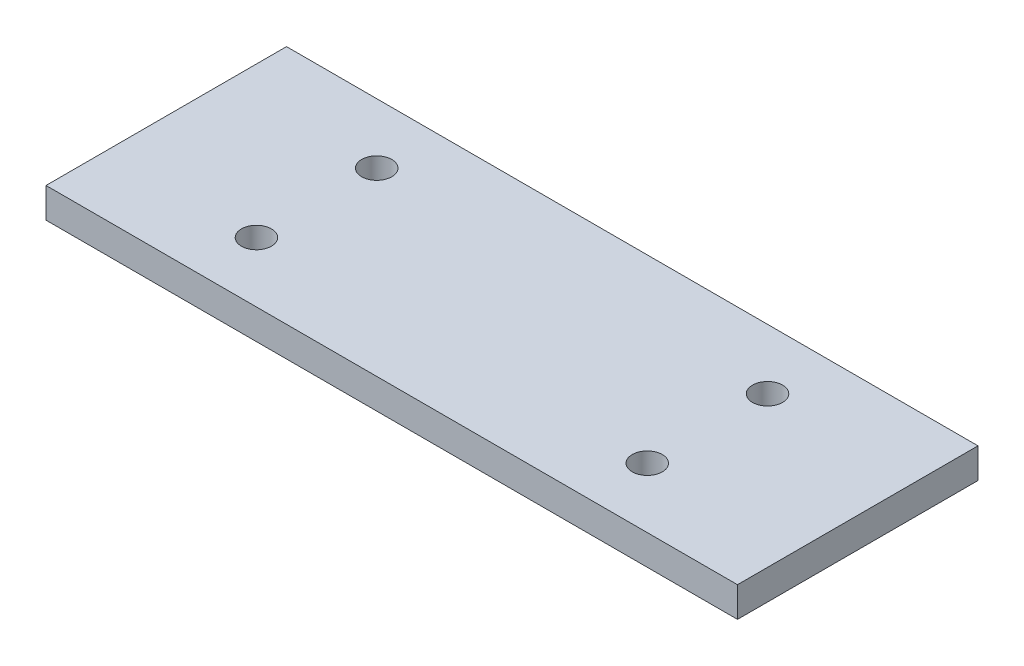
ISO-10303-21;
HEADER;
FILE_DESCRIPTION(('STEP AP214'),'2;1');
FILE_NAME('part.step','',(''),(''),'','','');
FILE_SCHEMA(('AUTOMOTIVE_DESIGN { 1 0 10303 214 1 1 1 1 }'));
ENDSEC;
DATA;
#1=APPLICATION_CONTEXT('core data for automotive mechanical design processes');
#2=APPLICATION_PROTOCOL_DEFINITION('international standard','automotive_design',2000,#1);
#3=PRODUCT_CONTEXT('',#1,'mechanical');
#4=PRODUCT('Part','Part','',(#3));
#5=PRODUCT_RELATED_PRODUCT_CATEGORY('part','',(#4));
#6=PRODUCT_DEFINITION_FORMATION('','',#4);
#7=PRODUCT_DEFINITION_CONTEXT('part definition',#1,'design');
#8=PRODUCT_DEFINITION('design','',#6,#7);
#9=PRODUCT_DEFINITION_SHAPE('','',#8);
#10=(LENGTH_UNIT() NAMED_UNIT(*) SI_UNIT(.MILLI.,.METRE.));
#11=(NAMED_UNIT(*) PLANE_ANGLE_UNIT() SI_UNIT($,.RADIAN.));
#12=(NAMED_UNIT(*) SI_UNIT($,.STERADIAN.) SOLID_ANGLE_UNIT());
#13=UNCERTAINTY_MEASURE_WITH_UNIT(LENGTH_MEASURE(1.E-05),#10,'distance_accuracy_value','');
#14=(GEOMETRIC_REPRESENTATION_CONTEXT(3) GLOBAL_UNCERTAINTY_ASSIGNED_CONTEXT((#13)) GLOBAL_UNIT_ASSIGNED_CONTEXT((#10,
#11,#12)) REPRESENTATION_CONTEXT('',''));
#15=CARTESIAN_POINT('',(0.,0.,0.));
#16=DIRECTION('',(0.,0.,1.));
#17=DIRECTION('',(1.,0.,0.));
#18=AXIS2_PLACEMENT_3D('',#15,#16,#17);
#19=CARTESIAN_POINT('',(0.,2.5,0.));
#20=DIRECTION('',(0.,-1.,0.));
#21=DIRECTION('',(0.,0.,-1.));
#22=AXIS2_PLACEMENT_3D('',#19,#20,#21);
#23=PLANE('',#22);
#24=DIRECTION('',(0.,0.,-1.));
#25=VECTOR('',#24,1.);
#26=CARTESIAN_POINT('',(57.5,2.5,20.));
#27=LINE('',#26,#25);
#28=CARTESIAN_POINT('',(57.5,2.5,20.));
#29=VERTEX_POINT('',#28);
#30=CARTESIAN_POINT('',(57.5,2.5,-20.));
#31=VERTEX_POINT('',#30);
#32=EDGE_CURVE('E85',#29,#31,#27,.T.);
#33=ORIENTED_EDGE('',*,*,#32,.T.);
#34=DIRECTION('',(-1.,0.,0.));
#35=VECTOR('',#34,1.);
#36=CARTESIAN_POINT('',(-57.5,2.5,-20.));
#37=LINE('',#36,#35);
#38=CARTESIAN_POINT('',(-57.5,2.5,-20.));
#39=VERTEX_POINT('',#38);
#40=EDGE_CURVE('E80',#31,#39,#37,.T.);
#41=ORIENTED_EDGE('',*,*,#40,.T.);
#42=DIRECTION('',(0.,0.,1.));
#43=VECTOR('',#42,1.);
#44=CARTESIAN_POINT('',(-57.5,2.5,20.));
#45=LINE('',#44,#43);
#46=CARTESIAN_POINT('',(-57.5,2.5,20.));
#47=VERTEX_POINT('',#46);
#48=EDGE_CURVE('E83',#39,#47,#45,.T.);
#49=ORIENTED_EDGE('',*,*,#48,.T.);
#50=DIRECTION('',(1.,0.,0.));
#51=VECTOR('',#50,1.);
#52=CARTESIAN_POINT('',(-57.5,2.5,20.));
#53=LINE('',#52,#51);
#54=EDGE_CURVE('E50',#47,#29,#53,.T.);
#55=ORIENTED_EDGE('',*,*,#54,.T.);
#56=EDGE_LOOP('',(#33,#41,#49,#55));
#57=FACE_BOUND('',#56,.T.);
#58=CARTESIAN_POINT('',(-32.5,2.5,-10.));
#59=DIRECTION('',(0.,1.,0.));
#60=DIRECTION('',(0.,0.,1.));
#61=AXIS2_PLACEMENT_3D('',#58,#59,#60);
#62=CIRCLE('',#61,2.5);
#63=CARTESIAN_POINT('',(-32.5,2.5,-7.5));
#64=VERTEX_POINT('',#63);
#65=EDGE_CURVE('E100',#64,#64,#62,.T.);
#66=ORIENTED_EDGE('',*,*,#65,.F.);
#67=EDGE_LOOP('',(#66));
#68=FACE_BOUND('',#67,.T.);
#69=CARTESIAN_POINT('',(32.5,2.5,-10.));
#70=DIRECTION('',(0.,1.,0.));
#71=DIRECTION('',(0.,0.,1.));
#72=AXIS2_PLACEMENT_3D('',#69,#70,#71);
#73=CIRCLE('',#72,2.5);
#74=CARTESIAN_POINT('',(32.5,2.5,-7.49999999999999));
#75=VERTEX_POINT('',#74);
#76=EDGE_CURVE('E115',#75,#75,#73,.T.);
#77=ORIENTED_EDGE('',*,*,#76,.F.);
#78=EDGE_LOOP('',(#77));
#79=FACE_BOUND('',#78,.T.);
#80=CARTESIAN_POINT('',(32.5000000000002,2.5,10.));
#81=DIRECTION('',(0.,1.,0.));
#82=DIRECTION('',(0.,0.,1.));
#83=AXIS2_PLACEMENT_3D('',#80,#81,#82);
#84=CIRCLE('',#83,2.5);
#85=CARTESIAN_POINT('',(32.5000000000002,2.5,12.5));
#86=VERTEX_POINT('',#85);
#87=EDGE_CURVE('E121',#86,#86,#84,.T.);
#88=ORIENTED_EDGE('',*,*,#87,.F.);
#89=EDGE_LOOP('',(#88));
#90=FACE_BOUND('',#89,.T.);
#91=CARTESIAN_POINT('',(-32.4999999999998,2.5,10.));
#92=DIRECTION('',(0.,1.,0.));
#93=DIRECTION('',(0.,0.,1.));
#94=AXIS2_PLACEMENT_3D('',#91,#92,#93);
#95=CIRCLE('',#94,2.5);
#96=CARTESIAN_POINT('',(-32.4999999999998,2.5,12.5));
#97=VERTEX_POINT('',#96);
#98=EDGE_CURVE('E127',#97,#97,#95,.T.);
#99=ORIENTED_EDGE('',*,*,#98,.F.);
#100=EDGE_LOOP('',(#99));
#101=FACE_BOUND('',#100,.T.);
#102=ADVANCED_FACE('F33',(#57,#68,#79,#90,#101),#23,.F.);
#103=CARTESIAN_POINT('',(0.,-2.5,0.));
#104=DIRECTION('',(0.,-1.,0.));
#105=DIRECTION('',(0.,0.,-1.));
#106=AXIS2_PLACEMENT_3D('',#103,#104,#105);
#107=PLANE('',#106);
#108=CARTESIAN_POINT('',(32.5000000000002,-2.5,10.));
#109=DIRECTION('',(0.,1.,0.));
#110=DIRECTION('',(0.,0.,1.));
#111=AXIS2_PLACEMENT_3D('',#108,#109,#110);
#112=CIRCLE('',#111,2.5);
#113=CARTESIAN_POINT('',(32.5000000000002,-2.5,12.5));
#114=VERTEX_POINT('',#113);
#115=EDGE_CURVE('E124',#114,#114,#112,.T.);
#116=ORIENTED_EDGE('',*,*,#115,.T.);
#117=EDGE_LOOP('',(#116));
#118=FACE_BOUND('',#117,.T.);
#119=CARTESIAN_POINT('',(-32.5,-2.5,-10.));
#120=DIRECTION('',(0.,1.,0.));
#121=DIRECTION('',(0.,0.,1.));
#122=AXIS2_PLACEMENT_3D('',#119,#120,#121);
#123=CIRCLE('',#122,2.5);
#124=CARTESIAN_POINT('',(-32.5,-2.5,-7.5));
#125=VERTEX_POINT('',#124);
#126=EDGE_CURVE('E112',#125,#125,#123,.T.);
#127=ORIENTED_EDGE('',*,*,#126,.T.);
#128=EDGE_LOOP('',(#127));
#129=FACE_BOUND('',#128,.T.);
#130=DIRECTION('',(0.,0.,-1.));
#131=VECTOR('',#130,1.);
#132=CARTESIAN_POINT('',(57.5,-2.5,20.));
#133=LINE('',#132,#131);
#134=CARTESIAN_POINT('',(57.5,-2.5,20.));
#135=VERTEX_POINT('',#134);
#136=CARTESIAN_POINT('',(57.5,-2.5,-20.));
#137=VERTEX_POINT('',#136);
#138=EDGE_CURVE('E97',#135,#137,#133,.T.);
#139=ORIENTED_EDGE('',*,*,#138,.F.);
#140=DIRECTION('',(1.,0.,0.));
#141=VECTOR('',#140,1.);
#142=CARTESIAN_POINT('',(-57.5,-2.5,20.));
#143=LINE('',#142,#141);
#144=CARTESIAN_POINT('',(-57.5,-2.5,20.));
#145=VERTEX_POINT('',#144);
#146=EDGE_CURVE('E73',#145,#135,#143,.T.);
#147=ORIENTED_EDGE('',*,*,#146,.F.);
#148=DIRECTION('',(0.,0.,1.));
#149=VECTOR('',#148,1.);
#150=CARTESIAN_POINT('',(-57.5,-2.5,20.));
#151=LINE('',#150,#149);
#152=CARTESIAN_POINT('',(-57.5,-2.5,-20.));
#153=VERTEX_POINT('',#152);
#154=EDGE_CURVE('E67',#153,#145,#151,.T.);
#155=ORIENTED_EDGE('',*,*,#154,.F.);
#156=DIRECTION('',(-1.,0.,0.));
#157=VECTOR('',#156,1.);
#158=CARTESIAN_POINT('',(-57.5,-2.5,-20.));
#159=LINE('',#158,#157);
#160=EDGE_CURVE('E89',#137,#153,#159,.T.);
#161=ORIENTED_EDGE('',*,*,#160,.F.);
#162=EDGE_LOOP('',(#139,#147,#155,#161));
#163=FACE_BOUND('',#162,.T.);
#164=CARTESIAN_POINT('',(32.5,-2.5,-10.));
#165=DIRECTION('',(0.,1.,0.));
#166=DIRECTION('',(0.,0.,1.));
#167=AXIS2_PLACEMENT_3D('',#164,#165,#166);
#168=CIRCLE('',#167,2.5);
#169=CARTESIAN_POINT('',(32.5,-2.5,-7.49999999999999));
#170=VERTEX_POINT('',#169);
#171=EDGE_CURVE('E118',#170,#170,#168,.T.);
#172=ORIENTED_EDGE('',*,*,#171,.T.);
#173=EDGE_LOOP('',(#172));
#174=FACE_BOUND('',#173,.T.);
#175=CARTESIAN_POINT('',(-32.4999999999998,-2.5,10.));
#176=DIRECTION('',(0.,1.,0.));
#177=DIRECTION('',(0.,0.,1.));
#178=AXIS2_PLACEMENT_3D('',#175,#176,#177);
#179=CIRCLE('',#178,2.5);
#180=CARTESIAN_POINT('',(-32.4999999999998,-2.5,12.5));
#181=VERTEX_POINT('',#180);
#182=EDGE_CURVE('E130',#181,#181,#179,.T.);
#183=ORIENTED_EDGE('',*,*,#182,.T.);
#184=EDGE_LOOP('',(#183));
#185=FACE_BOUND('',#184,.T.);
#186=ADVANCED_FACE('F108',(#118,#129,#163,#174,#185),#107,.T.);
#187=CARTESIAN_POINT('',(57.5,2.5,20.));
#188=DIRECTION('',(-1.,0.,0.));
#189=DIRECTION('',(0.,0.,1.));
#190=AXIS2_PLACEMENT_3D('',#187,#188,#189);
#191=PLANE('',#190);
#192=ORIENTED_EDGE('',*,*,#138,.T.);
#193=DIRECTION('',(0.,-1.,0.));
#194=VECTOR('',#193,1.);
#195=CARTESIAN_POINT('',(57.5,2.5,-20.));
#196=LINE('',#195,#194);
#197=EDGE_CURVE('E11',#31,#137,#196,.T.);
#198=ORIENTED_EDGE('',*,*,#197,.F.);
#199=ORIENTED_EDGE('',*,*,#32,.F.);
#200=DIRECTION('',(0.,-1.,0.));
#201=VECTOR('',#200,1.);
#202=CARTESIAN_POINT('',(57.5,2.5,20.));
#203=LINE('',#202,#201);
#204=EDGE_CURVE('E93',#29,#135,#203,.T.);
#205=ORIENTED_EDGE('',*,*,#204,.T.);
#206=EDGE_LOOP('',(#192,#198,#199,#205));
#207=FACE_BOUND('',#206,.T.);
#208=ADVANCED_FACE('F35',(#207),#191,.F.);
#209=CARTESIAN_POINT('',(-57.5,2.5,-20.));
#210=DIRECTION('',(0.,0.,1.));
#211=DIRECTION('',(1.,0.,0.));
#212=AXIS2_PLACEMENT_3D('',#209,#210,#211);
#213=PLANE('',#212);
#214=ORIENTED_EDGE('',*,*,#160,.T.);
#215=DIRECTION('',(0.,-1.,0.));
#216=VECTOR('',#215,1.);
#217=CARTESIAN_POINT('',(-57.5,2.5,-20.));
#218=LINE('',#217,#216);
#219=EDGE_CURVE('E42',#39,#153,#218,.T.);
#220=ORIENTED_EDGE('',*,*,#219,.F.);
#221=ORIENTED_EDGE('',*,*,#40,.F.);
#222=ORIENTED_EDGE('',*,*,#197,.T.);
#223=EDGE_LOOP('',(#214,#220,#221,#222));
#224=FACE_BOUND('',#223,.T.);
#225=ADVANCED_FACE('F88',(#224),#213,.F.);
#226=CARTESIAN_POINT('',(-57.5,2.5,20.));
#227=DIRECTION('',(1.,0.,0.));
#228=DIRECTION('',(0.,0.,-1.));
#229=AXIS2_PLACEMENT_3D('',#226,#227,#228);
#230=PLANE('',#229);
#231=ORIENTED_EDGE('',*,*,#154,.T.);
#232=DIRECTION('',(0.,-1.,0.));
#233=VECTOR('',#232,1.);
#234=CARTESIAN_POINT('',(-57.5,2.5,20.));
#235=LINE('',#234,#233);
#236=EDGE_CURVE('E90',#47,#145,#235,.T.);
#237=ORIENTED_EDGE('',*,*,#236,.F.);
#238=ORIENTED_EDGE('',*,*,#48,.F.);
#239=ORIENTED_EDGE('',*,*,#219,.T.);
#240=EDGE_LOOP('',(#231,#237,#238,#239));
#241=FACE_BOUND('',#240,.T.);
#242=ADVANCED_FACE('F91',(#241),#230,.F.);
#243=CARTESIAN_POINT('',(-57.5,2.5,20.));
#244=DIRECTION('',(0.,0.,-1.));
#245=DIRECTION('',(-1.,0.,0.));
#246=AXIS2_PLACEMENT_3D('',#243,#244,#245);
#247=PLANE('',#246);
#248=ORIENTED_EDGE('',*,*,#146,.T.);
#249=ORIENTED_EDGE('',*,*,#204,.F.);
#250=ORIENTED_EDGE('',*,*,#54,.F.);
#251=ORIENTED_EDGE('',*,*,#236,.T.);
#252=EDGE_LOOP('',(#248,#249,#250,#251));
#253=FACE_BOUND('',#252,.T.);
#254=ADVANCED_FACE('F105',(#253),#247,.F.);
#255=CARTESIAN_POINT('',(-32.5,2.5,-10.));
#256=DIRECTION('',(0.,-1.,0.));
#257=DIRECTION('',(0.,0.,-1.));
#258=AXIS2_PLACEMENT_3D('',#255,#256,#257);
#259=CYLINDRICAL_SURFACE('',#258,2.5);
#260=ORIENTED_EDGE('',*,*,#65,.T.);
#261=EDGE_LOOP('',(#260));
#262=FACE_BOUND('',#261,.T.);
#263=ORIENTED_EDGE('',*,*,#126,.F.);
#264=EDGE_LOOP('',(#263));
#265=FACE_BOUND('',#264,.T.);
#266=ADVANCED_FACE('F147',(#262,#265),#259,.F.);
#267=CARTESIAN_POINT('',(32.5,2.5,-10.));
#268=DIRECTION('',(0.,-1.,0.));
#269=DIRECTION('',(0.,0.,-1.));
#270=AXIS2_PLACEMENT_3D('',#267,#268,#269);
#271=CYLINDRICAL_SURFACE('',#270,2.5);
#272=ORIENTED_EDGE('',*,*,#76,.T.);
#273=EDGE_LOOP('',(#272));
#274=FACE_BOUND('',#273,.T.);
#275=ORIENTED_EDGE('',*,*,#171,.F.);
#276=EDGE_LOOP('',(#275));
#277=FACE_BOUND('',#276,.T.);
#278=ADVANCED_FACE('F193',(#274,#277),#271,.F.);
#279=CARTESIAN_POINT('',(32.5000000000002,2.5,10.));
#280=DIRECTION('',(0.,-1.,0.));
#281=DIRECTION('',(0.,0.,-1.));
#282=AXIS2_PLACEMENT_3D('',#279,#280,#281);
#283=CYLINDRICAL_SURFACE('',#282,2.5);
#284=ORIENTED_EDGE('',*,*,#87,.T.);
#285=EDGE_LOOP('',(#284));
#286=FACE_BOUND('',#285,.T.);
#287=ORIENTED_EDGE('',*,*,#115,.F.);
#288=EDGE_LOOP('',(#287));
#289=FACE_BOUND('',#288,.T.);
#290=ADVANCED_FACE('F201',(#286,#289),#283,.F.);
#291=CARTESIAN_POINT('',(-32.4999999999998,2.5,10.));
#292=DIRECTION('',(0.,-1.,0.));
#293=DIRECTION('',(0.,0.,-1.));
#294=AXIS2_PLACEMENT_3D('',#291,#292,#293);
#295=CYLINDRICAL_SURFACE('',#294,2.5);
#296=ORIENTED_EDGE('',*,*,#98,.T.);
#297=EDGE_LOOP('',(#296));
#298=FACE_BOUND('',#297,.T.);
#299=ORIENTED_EDGE('',*,*,#182,.F.);
#300=EDGE_LOOP('',(#299));
#301=FACE_BOUND('',#300,.T.);
#302=ADVANCED_FACE('F136',(#298,#301),#295,.F.);
#303=CLOSED_SHELL('',(#102,#186,#208,#225,#242,#254,#266,#278,#290,#302));
#304=MANIFOLD_SOLID_BREP('B2',#303);
#305=ADVANCED_BREP_SHAPE_REPRESENTATION('',(#18,#304),#14);
#306=SHAPE_DEFINITION_REPRESENTATION(#9,#305);
ENDSEC;
END-ISO-10303-21;
